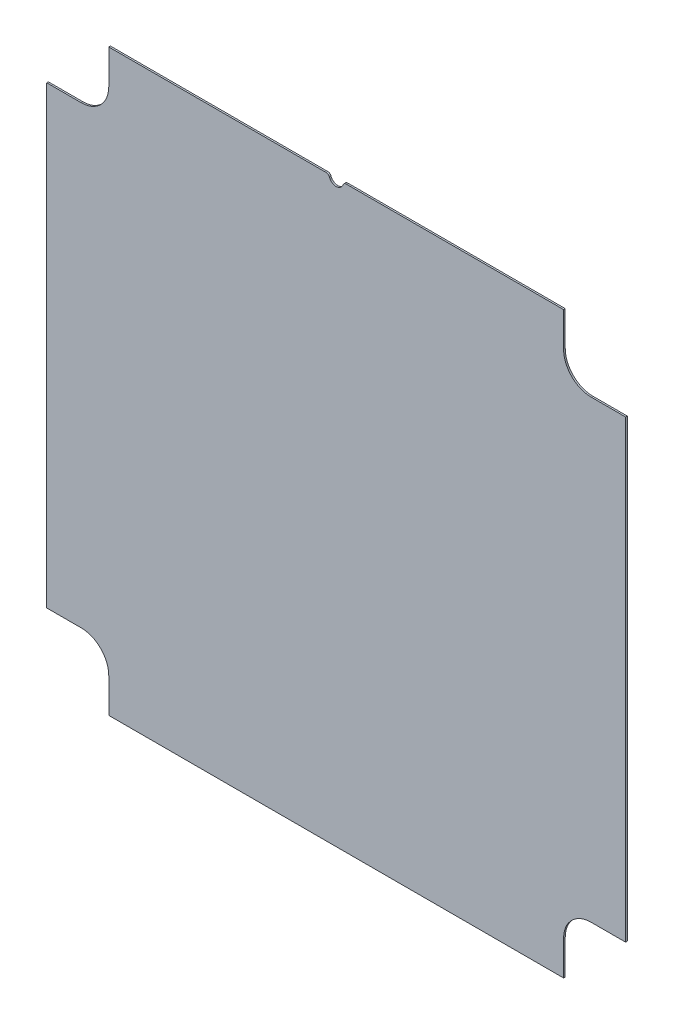
ISO-10303-21;
HEADER;
FILE_DESCRIPTION(('STEP AP214'),'2;1');
FILE_NAME('part.step','',(''),(''),'','','');
FILE_SCHEMA(('AUTOMOTIVE_DESIGN { 1 0 10303 214 1 1 1 1 }'));
ENDSEC;
DATA;
#1=APPLICATION_CONTEXT('core data for automotive mechanical design processes');
#2=APPLICATION_PROTOCOL_DEFINITION('international standard','automotive_design',2000,#1);
#3=PRODUCT_CONTEXT('',#1,'mechanical');
#4=PRODUCT('Part','Part','',(#3));
#5=PRODUCT_RELATED_PRODUCT_CATEGORY('part','',(#4));
#6=PRODUCT_DEFINITION_FORMATION('','',#4);
#7=PRODUCT_DEFINITION_CONTEXT('part definition',#1,'design');
#8=PRODUCT_DEFINITION('design','',#6,#7);
#9=PRODUCT_DEFINITION_SHAPE('','',#8);
#10=(LENGTH_UNIT() NAMED_UNIT(*) SI_UNIT(.MILLI.,.METRE.));
#11=(NAMED_UNIT(*) PLANE_ANGLE_UNIT() SI_UNIT($,.RADIAN.));
#12=(NAMED_UNIT(*) SI_UNIT($,.STERADIAN.) SOLID_ANGLE_UNIT());
#13=UNCERTAINTY_MEASURE_WITH_UNIT(LENGTH_MEASURE(1.E-05),#10,'distance_accuracy_value','');
#14=(GEOMETRIC_REPRESENTATION_CONTEXT(3) GLOBAL_UNCERTAINTY_ASSIGNED_CONTEXT((#13)) GLOBAL_UNIT_ASSIGNED_CONTEXT((#10,
#11,#12)) REPRESENTATION_CONTEXT('',''));
#15=CARTESIAN_POINT('',(0.,0.,0.));
#16=DIRECTION('',(0.,0.,1.));
#17=DIRECTION('',(1.,0.,0.));
#18=AXIS2_PLACEMENT_3D('',#15,#16,#17);
#19=CARTESIAN_POINT('',(-133.35,133.35,6.35));
#20=DIRECTION('',(0.,-1.,0.));
#21=DIRECTION('',(0.,0.,-1.));
#22=AXIS2_PLACEMENT_3D('',#19,#20,#21);
#23=PLANE('',#22);
#24=DIRECTION('',(-1.,0.,0.));
#25=VECTOR('',#24,1.);
#26=CARTESIAN_POINT('',(-133.35,133.35,6.35));
#27=LINE('',#26,#25);
#28=CARTESIAN_POINT('',(104.775,133.35,6.35));
#29=VERTEX_POINT('',#28);
#30=CARTESIAN_POINT('',(4.6246139298324,133.35,6.35));
#31=VERTEX_POINT('',#30);
#32=EDGE_CURVE('E226',#29,#31,#27,.T.);
#33=ORIENTED_EDGE('',*,*,#32,.F.);
#34=DIRECTION('',(0.,0.,1.));
#35=VECTOR('',#34,1.);
#36=CARTESIAN_POINT('',(104.775,133.35,5.58799999999997));
#37=LINE('',#36,#35);
#38=CARTESIAN_POINT('',(104.775,133.35,5.58799999999997));
#39=VERTEX_POINT('',#38);
#40=EDGE_CURVE('E270',#39,#29,#37,.T.);
#41=ORIENTED_EDGE('',*,*,#40,.F.);
#42=DIRECTION('',(1.,0.,0.));
#43=VECTOR('',#42,1.);
#44=CARTESIAN_POINT('',(-133.35,133.35,5.588));
#45=LINE('',#44,#43);
#46=CARTESIAN_POINT('',(4.6246139298324,133.35,5.588));
#47=VERTEX_POINT('',#46);
#48=EDGE_CURVE('E210',#47,#39,#45,.T.);
#49=ORIENTED_EDGE('',*,*,#48,.F.);
#50=DIRECTION('',(0.,0.,1.));
#51=VECTOR('',#50,1.);
#52=CARTESIAN_POINT('',(4.6246139298324,133.35,6.35));
#53=LINE('',#52,#51);
#54=EDGE_CURVE('E232',#47,#31,#53,.T.);
#55=ORIENTED_EDGE('',*,*,#54,.T.);
#56=EDGE_LOOP('',(#33,#41,#49,#55));
#57=FACE_BOUND('',#56,.T.);
#58=ADVANCED_FACE('F43',(#57),#23,.F.);
#59=CARTESIAN_POINT('',(0.,0.,6.35));
#60=DIRECTION('',(0.,0.,-1.));
#61=DIRECTION('',(-1.,0.,0.));
#62=AXIS2_PLACEMENT_3D('',#59,#60,#61);
#63=PLANE('',#62);
#64=DIRECTION('',(0.,1.,0.));
#65=VECTOR('',#64,1.);
#66=CARTESIAN_POINT('',(133.35,-133.35,6.35));
#67=LINE('',#66,#65);
#68=CARTESIAN_POINT('',(133.35,-104.775,6.35));
#69=VERTEX_POINT('',#68);
#70=CARTESIAN_POINT('',(133.35,104.775,6.35));
#71=VERTEX_POINT('',#70);
#72=EDGE_CURVE('E222',#69,#71,#67,.T.);
#73=ORIENTED_EDGE('',*,*,#72,.T.);
#74=DIRECTION('',(1.,0.,0.));
#75=VECTOR('',#74,1.);
#76=CARTESIAN_POINT('',(133.35,104.775,6.35));
#77=LINE('',#76,#75);
#78=CARTESIAN_POINT('',(117.475,104.775,6.35));
#79=VERTEX_POINT('',#78);
#80=EDGE_CURVE('E339',#79,#71,#77,.T.);
#81=ORIENTED_EDGE('',*,*,#80,.F.);
#82=CARTESIAN_POINT('',(117.475,117.475,6.35));
#83=DIRECTION('',(0.,0.,1.));
#84=DIRECTION('',(-1.,0.,0.));
#85=AXIS2_PLACEMENT_3D('',#82,#83,#84);
#86=CIRCLE('',#85,12.7);
#87=CARTESIAN_POINT('',(104.775,117.475,6.35));
#88=VERTEX_POINT('',#87);
#89=EDGE_CURVE('E343',#88,#79,#86,.T.);
#90=ORIENTED_EDGE('',*,*,#89,.F.);
#91=DIRECTION('',(0.,-1.,0.));
#92=VECTOR('',#91,1.);
#93=CARTESIAN_POINT('',(104.775,117.475,6.35));
#94=LINE('',#93,#92);
#95=EDGE_CURVE('E341',#29,#88,#94,.T.);
#96=ORIENTED_EDGE('',*,*,#95,.F.);
#97=ORIENTED_EDGE('',*,*,#32,.T.);
#98=CARTESIAN_POINT('',(4.62461392983241,131.7625,6.35));
#99=DIRECTION('',(0.,0.,-1.));
#100=DIRECTION('',(-1.,0.,0.));
#101=AXIS2_PLACEMENT_3D('',#98,#99,#100);
#102=CIRCLE('',#101,1.5875);
#103=CARTESIAN_POINT('',(3.12311590066604,132.277922077922,6.35));
#104=VERTEX_POINT('',#103);
#105=EDGE_CURVE('E237',#31,#104,#102,.F.);
#106=ORIENTED_EDGE('',*,*,#105,.T.);
#107=CARTESIAN_POINT('',(0.,133.35,6.35));
#108=DIRECTION('',(0.,0.,1.));
#109=DIRECTION('',(1.,0.,0.));
#110=AXIS2_PLACEMENT_3D('',#107,#108,#109);
#111=CIRCLE('',#110,3.302);
#112=CARTESIAN_POINT('',(-3.12311590066604,132.277922077922,6.35));
#113=VERTEX_POINT('',#112);
#114=EDGE_CURVE('E219',#113,#104,#111,.T.);
#115=ORIENTED_EDGE('',*,*,#114,.F.);
#116=CARTESIAN_POINT('',(-4.62461392983241,131.7625,6.35));
#117=DIRECTION('',(0.,0.,-1.));
#118=DIRECTION('',(-1.,0.,0.));
#119=AXIS2_PLACEMENT_3D('',#116,#117,#118);
#120=CIRCLE('',#119,1.5875);
#121=CARTESIAN_POINT('',(-4.6246139298324,133.35,6.35));
#122=VERTEX_POINT('',#121);
#123=EDGE_CURVE('E235',#113,#122,#120,.F.);
#124=ORIENTED_EDGE('',*,*,#123,.T.);
#125=CARTESIAN_POINT('',(-104.775,133.35,6.35));
#126=VERTEX_POINT('',#125);
#127=EDGE_CURVE('E225',#122,#126,#27,.T.);
#128=ORIENTED_EDGE('',*,*,#127,.T.);
#129=DIRECTION('',(0.,1.,0.));
#130=VECTOR('',#129,1.);
#131=CARTESIAN_POINT('',(-104.775,117.475,6.35));
#132=LINE('',#131,#130);
#133=CARTESIAN_POINT('',(-104.775,117.475,6.35));
#134=VERTEX_POINT('',#133);
#135=EDGE_CURVE('E287',#134,#126,#132,.T.);
#136=ORIENTED_EDGE('',*,*,#135,.F.);
#137=CARTESIAN_POINT('',(-117.475,117.475,6.35));
#138=DIRECTION('',(0.,0.,1.));
#139=DIRECTION('',(1.,0.,0.));
#140=AXIS2_PLACEMENT_3D('',#137,#138,#139);
#141=CIRCLE('',#140,12.7);
#142=CARTESIAN_POINT('',(-117.475,104.775,6.35));
#143=VERTEX_POINT('',#142);
#144=EDGE_CURVE('E296',#143,#134,#141,.T.);
#145=ORIENTED_EDGE('',*,*,#144,.F.);
#146=DIRECTION('',(1.,0.,0.));
#147=VECTOR('',#146,1.);
#148=CARTESIAN_POINT('',(-133.35,104.775,6.35));
#149=LINE('',#148,#147);
#150=CARTESIAN_POINT('',(-133.35,104.775,6.35));
#151=VERTEX_POINT('',#150);
#152=EDGE_CURVE('E293',#151,#143,#149,.T.);
#153=ORIENTED_EDGE('',*,*,#152,.F.);
#154=DIRECTION('',(0.,-1.,0.));
#155=VECTOR('',#154,1.);
#156=CARTESIAN_POINT('',(-133.35,-133.35,6.35));
#157=LINE('',#156,#155);
#158=CARTESIAN_POINT('',(-133.35,-104.775,6.35));
#159=VERTEX_POINT('',#158);
#160=EDGE_CURVE('E228',#151,#159,#157,.T.);
#161=ORIENTED_EDGE('',*,*,#160,.T.);
#162=DIRECTION('',(-1.,0.,0.));
#163=VECTOR('',#162,1.);
#164=CARTESIAN_POINT('',(-133.35,-104.775,6.35));
#165=LINE('',#164,#163);
#166=CARTESIAN_POINT('',(-117.475,-104.775,6.35));
#167=VERTEX_POINT('',#166);
#168=EDGE_CURVE('E187',#167,#159,#165,.T.);
#169=ORIENTED_EDGE('',*,*,#168,.F.);
#170=CARTESIAN_POINT('',(-117.475,-117.475,6.35));
#171=DIRECTION('',(0.,0.,1.));
#172=DIRECTION('',(-1.,0.,0.));
#173=AXIS2_PLACEMENT_3D('',#170,#171,#172);
#174=CIRCLE('',#173,12.7);
#175=CARTESIAN_POINT('',(-104.775,-117.475,6.35));
#176=VERTEX_POINT('',#175);
#177=EDGE_CURVE('E372',#176,#167,#174,.T.);
#178=ORIENTED_EDGE('',*,*,#177,.F.);
#179=DIRECTION('',(0.,1.,0.));
#180=VECTOR('',#179,1.);
#181=CARTESIAN_POINT('',(-104.775,-117.475,6.35));
#182=LINE('',#181,#180);
#183=CARTESIAN_POINT('',(-104.775,-133.35,6.35));
#184=VERTEX_POINT('',#183);
#185=EDGE_CURVE('E330',#184,#176,#182,.T.);
#186=ORIENTED_EDGE('',*,*,#185,.F.);
#187=DIRECTION('',(1.,0.,0.));
#188=VECTOR('',#187,1.);
#189=CARTESIAN_POINT('',(-133.35,-133.35,6.35));
#190=LINE('',#189,#188);
#191=CARTESIAN_POINT('',(104.775,-133.35,6.35));
#192=VERTEX_POINT('',#191);
#193=EDGE_CURVE('E196',#184,#192,#190,.T.);
#194=ORIENTED_EDGE('',*,*,#193,.T.);
#195=DIRECTION('',(0.,-1.,0.));
#196=VECTOR('',#195,1.);
#197=CARTESIAN_POINT('',(104.775,-117.475,6.35));
#198=LINE('',#197,#196);
#199=CARTESIAN_POINT('',(104.775,-117.475,6.35));
#200=VERTEX_POINT('',#199);
#201=EDGE_CURVE('E360',#200,#192,#198,.T.);
#202=ORIENTED_EDGE('',*,*,#201,.F.);
#203=CARTESIAN_POINT('',(117.475,-117.475,6.35));
#204=DIRECTION('',(0.,0.,1.));
#205=DIRECTION('',(1.,0.,0.));
#206=AXIS2_PLACEMENT_3D('',#203,#204,#205);
#207=CIRCLE('',#206,12.7);
#208=CARTESIAN_POINT('',(117.475,-104.775,6.35));
#209=VERTEX_POINT('',#208);
#210=EDGE_CURVE('E347',#209,#200,#207,.T.);
#211=ORIENTED_EDGE('',*,*,#210,.F.);
#212=DIRECTION('',(-1.,0.,0.));
#213=VECTOR('',#212,1.);
#214=CARTESIAN_POINT('',(133.35,-104.775,6.35));
#215=LINE('',#214,#213);
#216=EDGE_CURVE('E356',#69,#209,#215,.T.);
#217=ORIENTED_EDGE('',*,*,#216,.F.);
#218=EDGE_LOOP('',(#73,#81,#90,#96,#97,#106,#115,#124,#128,#136,#145,#153,#161,#169,#178,#186,
#194,#202,#211,#217));
#219=FACE_BOUND('',#218,.T.);
#220=ADVANCED_FACE('F354',(#219),#63,.F.);
#221=CARTESIAN_POINT('',(133.35,-133.35,6.35));
#222=DIRECTION('',(-1.,0.,0.));
#223=DIRECTION('',(0.,0.,1.));
#224=AXIS2_PLACEMENT_3D('',#221,#222,#223);
#225=PLANE('',#224);
#226=DIRECTION('',(0.,-1.,0.));
#227=VECTOR('',#226,1.);
#228=CARTESIAN_POINT('',(133.35,133.35,5.588));
#229=LINE('',#228,#227);
#230=CARTESIAN_POINT('',(133.35,104.775,5.58799999999997));
#231=VERTEX_POINT('',#230);
#232=CARTESIAN_POINT('',(133.35,-104.775,5.58799999999997));
#233=VERTEX_POINT('',#232);
#234=EDGE_CURVE('E213',#231,#233,#229,.T.);
#235=ORIENTED_EDGE('',*,*,#234,.F.);
#236=DIRECTION('',(0.,0.,1.));
#237=VECTOR('',#236,1.);
#238=CARTESIAN_POINT('',(133.35,104.775,5.58799999999997));
#239=LINE('',#238,#237);
#240=EDGE_CURVE('E322',#231,#71,#239,.T.);
#241=ORIENTED_EDGE('',*,*,#240,.T.);
#242=ORIENTED_EDGE('',*,*,#72,.F.);
#243=DIRECTION('',(0.,0.,1.));
#244=VECTOR('',#243,1.);
#245=CARTESIAN_POINT('',(133.35,-104.775,5.58799999999997));
#246=LINE('',#245,#244);
#247=EDGE_CURVE('E323',#233,#69,#246,.T.);
#248=ORIENTED_EDGE('',*,*,#247,.F.);
#249=EDGE_LOOP('',(#235,#241,#242,#248));
#250=FACE_BOUND('',#249,.T.);
#251=ADVANCED_FACE('F320',(#250),#225,.F.);
#252=CARTESIAN_POINT('',(-104.775,133.35,5.58799999999997));
#253=VERTEX_POINT('',#252);
#254=CARTESIAN_POINT('',(-4.6246139298324,133.35,5.588));
#255=VERTEX_POINT('',#254);
#256=EDGE_CURVE('E205',#253,#255,#45,.T.);
#257=ORIENTED_EDGE('',*,*,#256,.F.);
#258=DIRECTION('',(0.,0.,1.));
#259=VECTOR('',#258,1.);
#260=CARTESIAN_POINT('',(-104.775,133.35,5.58799999999997));
#261=LINE('',#260,#259);
#262=EDGE_CURVE('E301',#253,#126,#261,.T.);
#263=ORIENTED_EDGE('',*,*,#262,.T.);
#264=ORIENTED_EDGE('',*,*,#127,.F.);
#265=DIRECTION('',(0.,0.,1.));
#266=VECTOR('',#265,1.);
#267=CARTESIAN_POINT('',(-4.6246139298324,133.35,6.35));
#268=LINE('',#267,#266);
#269=EDGE_CURVE('E51',#122,#255,#268,.F.);
#270=ORIENTED_EDGE('',*,*,#269,.T.);
#271=EDGE_LOOP('',(#257,#263,#264,#270));
#272=FACE_BOUND('',#271,.T.);
#273=ADVANCED_FACE('F248',(#272),#23,.F.);
#274=CARTESIAN_POINT('',(-133.35,-133.35,6.35));
#275=DIRECTION('',(1.,0.,0.));
#276=DIRECTION('',(0.,0.,-1.));
#277=AXIS2_PLACEMENT_3D('',#274,#275,#276);
#278=PLANE('',#277);
#279=DIRECTION('',(0.,-1.,0.));
#280=VECTOR('',#279,1.);
#281=CARTESIAN_POINT('',(-133.35,133.35,5.588));
#282=LINE('',#281,#280);
#283=CARTESIAN_POINT('',(-133.35,104.775,5.58799999999997));
#284=VERTEX_POINT('',#283);
#285=CARTESIAN_POINT('',(-133.35,-104.775,5.58799999999997));
#286=VERTEX_POINT('',#285);
#287=EDGE_CURVE('E216',#284,#286,#282,.T.);
#288=ORIENTED_EDGE('',*,*,#287,.T.);
#289=DIRECTION('',(0.,0.,1.));
#290=VECTOR('',#289,1.);
#291=CARTESIAN_POINT('',(-133.35,-104.775,5.58799999999997));
#292=LINE('',#291,#290);
#293=EDGE_CURVE('E297',#286,#159,#292,.T.);
#294=ORIENTED_EDGE('',*,*,#293,.T.);
#295=ORIENTED_EDGE('',*,*,#160,.F.);
#296=DIRECTION('',(0.,0.,1.));
#297=VECTOR('',#296,1.);
#298=CARTESIAN_POINT('',(-133.35,104.775,5.58799999999997));
#299=LINE('',#298,#297);
#300=EDGE_CURVE('E292',#284,#151,#299,.T.);
#301=ORIENTED_EDGE('',*,*,#300,.F.);
#302=EDGE_LOOP('',(#288,#294,#295,#301));
#303=FACE_BOUND('',#302,.T.);
#304=ADVANCED_FACE('F383',(#303),#278,.F.);
#305=CARTESIAN_POINT('',(-133.35,-133.35,6.35));
#306=DIRECTION('',(0.,1.,0.));
#307=DIRECTION('',(0.,0.,1.));
#308=AXIS2_PLACEMENT_3D('',#305,#306,#307);
#309=PLANE('',#308);
#310=DIRECTION('',(1.,0.,0.));
#311=VECTOR('',#310,1.);
#312=CARTESIAN_POINT('',(-133.35,-133.35,5.58799999999997));
#313=LINE('',#312,#311);
#314=CARTESIAN_POINT('',(-104.775,-133.35,5.58799999999997));
#315=VERTEX_POINT('',#314);
#316=CARTESIAN_POINT('',(104.775,-133.35,5.58799999999997));
#317=VERTEX_POINT('',#316);
#318=EDGE_CURVE('E194',#315,#317,#313,.T.);
#319=ORIENTED_EDGE('',*,*,#318,.T.);
#320=DIRECTION('',(0.,0.,1.));
#321=VECTOR('',#320,1.);
#322=CARTESIAN_POINT('',(104.775,-133.35,5.58799999999997));
#323=LINE('',#322,#321);
#324=EDGE_CURVE('E328',#317,#192,#323,.T.);
#325=ORIENTED_EDGE('',*,*,#324,.T.);
#326=ORIENTED_EDGE('',*,*,#193,.F.);
#327=DIRECTION('',(0.,0.,1.));
#328=VECTOR('',#327,1.);
#329=CARTESIAN_POINT('',(-104.775,-133.35,5.58799999999997));
#330=LINE('',#329,#328);
#331=EDGE_CURVE('E182',#315,#184,#330,.T.);
#332=ORIENTED_EDGE('',*,*,#331,.F.);
#333=EDGE_LOOP('',(#319,#325,#326,#332));
#334=FACE_BOUND('',#333,.T.);
#335=ADVANCED_FACE('F192',(#334),#309,.F.);
#336=CARTESIAN_POINT('',(0.,133.35,0.));
#337=DIRECTION('',(0.,0.,1.));
#338=DIRECTION('',(1.,0.,0.));
#339=AXIS2_PLACEMENT_3D('',#336,#337,#338);
#340=CYLINDRICAL_SURFACE('',#339,3.302);
#341=DIRECTION('',(0.,0.,1.));
#342=VECTOR('',#341,1.);
#343=CARTESIAN_POINT('',(3.12311590066605,132.277922077922,0.));
#344=LINE('',#343,#342);
#345=CARTESIAN_POINT('',(3.12311590066605,132.277922077922,5.588));
#346=VERTEX_POINT('',#345);
#347=EDGE_CURVE('E241',#104,#346,#344,.F.);
#348=ORIENTED_EDGE('',*,*,#347,.T.);
#349=CARTESIAN_POINT('',(0.,133.35,5.588));
#350=DIRECTION('',(0.,0.,1.));
#351=DIRECTION('',(0.,-1.,0.));
#352=AXIS2_PLACEMENT_3D('',#349,#350,#351);
#353=CIRCLE('',#352,3.302);
#354=CARTESIAN_POINT('',(-3.12311590066604,132.277922077922,5.588));
#355=VERTEX_POINT('',#354);
#356=EDGE_CURVE('E204',#346,#355,#353,.F.);
#357=ORIENTED_EDGE('',*,*,#356,.T.);
#358=DIRECTION('',(0.,0.,1.));
#359=VECTOR('',#358,1.);
#360=CARTESIAN_POINT('',(-3.12311590066605,132.277922077922,0.));
#361=LINE('',#360,#359);
#362=EDGE_CURVE('E239',#355,#113,#361,.T.);
#363=ORIENTED_EDGE('',*,*,#362,.T.);
#364=ORIENTED_EDGE('',*,*,#114,.T.);
#365=EDGE_LOOP('',(#348,#357,#363,#364));
#366=FACE_BOUND('',#365,.T.);
#367=ADVANCED_FACE('F258',(#366),#340,.F.);
#368=CARTESIAN_POINT('',(4.62461392983241,131.7625,0.));
#369=DIRECTION('',(0.,0.,1.));
#370=DIRECTION('',(1.,0.,0.));
#371=AXIS2_PLACEMENT_3D('',#368,#369,#370);
#372=CYLINDRICAL_SURFACE('',#371,1.5875);
#373=CARTESIAN_POINT('',(4.62461392983241,131.7625,5.588));
#374=DIRECTION('',(0.,0.,1.));
#375=DIRECTION('',(0.,-1.,0.));
#376=AXIS2_PLACEMENT_3D('',#373,#374,#375);
#377=CIRCLE('',#376,1.5875);
#378=EDGE_CURVE('E208',#346,#47,#377,.F.);
#379=ORIENTED_EDGE('',*,*,#378,.F.);
#380=ORIENTED_EDGE('',*,*,#347,.F.);
#381=ORIENTED_EDGE('',*,*,#105,.F.);
#382=ORIENTED_EDGE('',*,*,#54,.F.);
#383=EDGE_LOOP('',(#379,#380,#381,#382));
#384=FACE_BOUND('',#383,.T.);
#385=ADVANCED_FACE('F263',(#384),#372,.T.);
#386=CARTESIAN_POINT('',(-4.62461392983241,131.7625,0.));
#387=DIRECTION('',(0.,0.,1.));
#388=DIRECTION('',(1.,0.,0.));
#389=AXIS2_PLACEMENT_3D('',#386,#387,#388);
#390=CYLINDRICAL_SURFACE('',#389,1.5875);
#391=CARTESIAN_POINT('',(-4.62461392983241,131.7625,5.588));
#392=DIRECTION('',(0.,0.,1.));
#393=DIRECTION('',(0.,-1.,0.));
#394=AXIS2_PLACEMENT_3D('',#391,#392,#393);
#395=CIRCLE('',#394,1.5875);
#396=EDGE_CURVE('E11',#255,#355,#395,.F.);
#397=ORIENTED_EDGE('',*,*,#396,.F.);
#398=ORIENTED_EDGE('',*,*,#269,.F.);
#399=ORIENTED_EDGE('',*,*,#123,.F.);
#400=ORIENTED_EDGE('',*,*,#362,.F.);
#401=EDGE_LOOP('',(#397,#398,#399,#400));
#402=FACE_BOUND('',#401,.T.);
#403=ADVANCED_FACE('F45',(#402),#390,.T.);
#404=CARTESIAN_POINT('',(-133.35,133.35,5.588));
#405=DIRECTION('',(0.,0.,1.));
#406=DIRECTION('',(0.,-1.,0.));
#407=AXIS2_PLACEMENT_3D('',#404,#405,#406);
#408=PLANE('',#407);
#409=CARTESIAN_POINT('',(117.475,117.475,5.58799999999997));
#410=DIRECTION('',(0.,0.,1.));
#411=DIRECTION('',(-1.,0.,0.));
#412=AXIS2_PLACEMENT_3D('',#409,#410,#411);
#413=CIRCLE('',#412,12.7);
#414=CARTESIAN_POINT('',(104.775,117.475,5.588));
#415=VERTEX_POINT('',#414);
#416=CARTESIAN_POINT('',(117.475,104.775,5.58799999999997));
#417=VERTEX_POINT('',#416);
#418=EDGE_CURVE('E58',#415,#417,#413,.T.);
#419=ORIENTED_EDGE('',*,*,#418,.T.);
#420=DIRECTION('',(1.,0.,0.));
#421=VECTOR('',#420,1.);
#422=CARTESIAN_POINT('',(133.35,104.775,5.58799999999997));
#423=LINE('',#422,#421);
#424=EDGE_CURVE('E275',#417,#231,#423,.T.);
#425=ORIENTED_EDGE('',*,*,#424,.T.);
#426=ORIENTED_EDGE('',*,*,#234,.T.);
#427=DIRECTION('',(-1.,0.,0.));
#428=VECTOR('',#427,1.);
#429=CARTESIAN_POINT('',(133.35,-104.775,5.58799999999997));
#430=LINE('',#429,#428);
#431=CARTESIAN_POINT('',(117.475,-104.775,5.58799999999997));
#432=VERTEX_POINT('',#431);
#433=EDGE_CURVE('E315',#233,#432,#430,.T.);
#434=ORIENTED_EDGE('',*,*,#433,.T.);
#435=CARTESIAN_POINT('',(117.475,-117.475,5.58799999999997));
#436=DIRECTION('',(0.,0.,1.));
#437=DIRECTION('',(1.,0.,0.));
#438=AXIS2_PLACEMENT_3D('',#435,#436,#437);
#439=CIRCLE('',#438,12.7);
#440=CARTESIAN_POINT('',(104.775,-117.475,5.58799999999997));
#441=VERTEX_POINT('',#440);
#442=EDGE_CURVE('E359',#432,#441,#439,.T.);
#443=ORIENTED_EDGE('',*,*,#442,.T.);
#444=DIRECTION('',(0.,-1.,0.));
#445=VECTOR('',#444,1.);
#446=CARTESIAN_POINT('',(104.775,-117.475,5.58799999999997));
#447=LINE('',#446,#445);
#448=EDGE_CURVE('E203',#441,#317,#447,.T.);
#449=ORIENTED_EDGE('',*,*,#448,.T.);
#450=ORIENTED_EDGE('',*,*,#318,.F.);
#451=DIRECTION('',(0.,1.,0.));
#452=VECTOR('',#451,1.);
#453=CARTESIAN_POINT('',(-104.775,-117.475,5.58799999999997));
#454=LINE('',#453,#452);
#455=CARTESIAN_POINT('',(-104.775,-117.475,5.58799999999997));
#456=VERTEX_POINT('',#455);
#457=EDGE_CURVE('E178',#315,#456,#454,.T.);
#458=ORIENTED_EDGE('',*,*,#457,.T.);
#459=CARTESIAN_POINT('',(-117.475,-117.475,5.58799999999997));
#460=DIRECTION('',(0.,0.,1.));
#461=DIRECTION('',(-1.,0.,0.));
#462=AXIS2_PLACEMENT_3D('',#459,#460,#461);
#463=CIRCLE('',#462,12.7);
#464=CARTESIAN_POINT('',(-117.475,-104.775,5.58799999999997));
#465=VERTEX_POINT('',#464);
#466=EDGE_CURVE('E66',#456,#465,#463,.T.);
#467=ORIENTED_EDGE('',*,*,#466,.T.);
#468=DIRECTION('',(-1.,0.,0.));
#469=VECTOR('',#468,1.);
#470=CARTESIAN_POINT('',(-133.35,-104.775,5.58799999999997));
#471=LINE('',#470,#469);
#472=EDGE_CURVE('E197',#465,#286,#471,.T.);
#473=ORIENTED_EDGE('',*,*,#472,.T.);
#474=ORIENTED_EDGE('',*,*,#287,.F.);
#475=DIRECTION('',(1.,0.,0.));
#476=VECTOR('',#475,1.);
#477=CARTESIAN_POINT('',(-133.35,104.775,5.58799999999997));
#478=LINE('',#477,#476);
#479=CARTESIAN_POINT('',(-117.475,104.775,5.588));
#480=VERTEX_POINT('',#479);
#481=EDGE_CURVE('E283',#284,#480,#478,.T.);
#482=ORIENTED_EDGE('',*,*,#481,.T.);
#483=CARTESIAN_POINT('',(-117.475,117.475,5.58799999999997));
#484=DIRECTION('',(0.,0.,1.));
#485=DIRECTION('',(1.,0.,0.));
#486=AXIS2_PLACEMENT_3D('',#483,#484,#485);
#487=CIRCLE('',#486,12.7);
#488=CARTESIAN_POINT('',(-104.775,117.475,5.58799999999997));
#489=VERTEX_POINT('',#488);
#490=EDGE_CURVE('E286',#480,#489,#487,.T.);
#491=ORIENTED_EDGE('',*,*,#490,.T.);
#492=DIRECTION('',(0.,1.,0.));
#493=VECTOR('',#492,1.);
#494=CARTESIAN_POINT('',(-104.775,117.475,5.58799999999997));
#495=LINE('',#494,#493);
#496=EDGE_CURVE('E290',#489,#253,#495,.T.);
#497=ORIENTED_EDGE('',*,*,#496,.T.);
#498=ORIENTED_EDGE('',*,*,#256,.T.);
#499=ORIENTED_EDGE('',*,*,#396,.T.);
#500=ORIENTED_EDGE('',*,*,#356,.F.);
#501=ORIENTED_EDGE('',*,*,#378,.T.);
#502=ORIENTED_EDGE('',*,*,#48,.T.);
#503=DIRECTION('',(0.,-1.,0.));
#504=VECTOR('',#503,1.);
#505=CARTESIAN_POINT('',(104.775,117.475,5.58799999999997));
#506=LINE('',#505,#504);
#507=EDGE_CURVE('E337',#39,#415,#506,.T.);
#508=ORIENTED_EDGE('',*,*,#507,.T.);
#509=EDGE_LOOP('',(#419,#425,#426,#434,#443,#449,#450,#458,#467,#473,#474,#482,#491,#497,#498,
#499,#500,#501,#502,#508));
#510=FACE_BOUND('',#509,.T.);
#511=ADVANCED_FACE('F200',(#510),#408,.F.);
#512=CARTESIAN_POINT('',(-104.775,117.475,5.58799999999997));
#513=DIRECTION('',(1.,0.,0.));
#514=DIRECTION('',(0.,0.,-1.));
#515=AXIS2_PLACEMENT_3D('',#512,#513,#514);
#516=PLANE('',#515);
#517=ORIENTED_EDGE('',*,*,#135,.T.);
#518=ORIENTED_EDGE('',*,*,#262,.F.);
#519=ORIENTED_EDGE('',*,*,#496,.F.);
#520=DIRECTION('',(0.,0.,1.));
#521=VECTOR('',#520,1.);
#522=CARTESIAN_POINT('',(-104.775,117.475,5.58799999999997));
#523=LINE('',#522,#521);
#524=EDGE_CURVE('E303',#489,#134,#523,.T.);
#525=ORIENTED_EDGE('',*,*,#524,.T.);
#526=EDGE_LOOP('',(#517,#518,#519,#525));
#527=FACE_BOUND('',#526,.T.);
#528=ADVANCED_FACE('F395',(#527),#516,.F.);
#529=CARTESIAN_POINT('',(-117.475,117.475,5.58799999999997));
#530=DIRECTION('',(0.,0.,1.));
#531=DIRECTION('',(1.,0.,0.));
#532=AXIS2_PLACEMENT_3D('',#529,#530,#531);
#533=CYLINDRICAL_SURFACE('',#532,12.7);
#534=ORIENTED_EDGE('',*,*,#144,.T.);
#535=ORIENTED_EDGE('',*,*,#524,.F.);
#536=ORIENTED_EDGE('',*,*,#490,.F.);
#537=DIRECTION('',(0.,0.,1.));
#538=VECTOR('',#537,1.);
#539=CARTESIAN_POINT('',(-117.475,104.775,5.58799999999997));
#540=LINE('',#539,#538);
#541=EDGE_CURVE('E305',#480,#143,#540,.T.);
#542=ORIENTED_EDGE('',*,*,#541,.T.);
#543=EDGE_LOOP('',(#534,#535,#536,#542));
#544=FACE_BOUND('',#543,.T.);
#545=ADVANCED_FACE('F393',(#544),#533,.F.);
#546=CARTESIAN_POINT('',(-133.35,104.775,5.58799999999997));
#547=DIRECTION('',(0.,-1.,0.));
#548=DIRECTION('',(1.,0.,0.));
#549=AXIS2_PLACEMENT_3D('',#546,#547,#548);
#550=PLANE('',#549);
#551=ORIENTED_EDGE('',*,*,#152,.T.);
#552=ORIENTED_EDGE('',*,*,#541,.F.);
#553=ORIENTED_EDGE('',*,*,#481,.F.);
#554=ORIENTED_EDGE('',*,*,#300,.T.);
#555=EDGE_LOOP('',(#551,#552,#553,#554));
#556=FACE_BOUND('',#555,.T.);
#557=ADVANCED_FACE('F390',(#556),#550,.F.);
#558=CARTESIAN_POINT('',(-133.35,-104.775,5.58799999999997));
#559=DIRECTION('',(0.,1.,0.));
#560=DIRECTION('',(-1.,0.,0.));
#561=AXIS2_PLACEMENT_3D('',#558,#559,#560);
#562=PLANE('',#561);
#563=ORIENTED_EDGE('',*,*,#168,.T.);
#564=ORIENTED_EDGE('',*,*,#293,.F.);
#565=ORIENTED_EDGE('',*,*,#472,.F.);
#566=DIRECTION('',(0.,0.,1.));
#567=VECTOR('',#566,1.);
#568=CARTESIAN_POINT('',(-117.475,-104.775,5.58799999999997));
#569=LINE('',#568,#567);
#570=EDGE_CURVE('E368',#465,#167,#569,.T.);
#571=ORIENTED_EDGE('',*,*,#570,.T.);
#572=EDGE_LOOP('',(#563,#564,#565,#571));
#573=FACE_BOUND('',#572,.T.);
#574=ADVANCED_FACE('F380',(#573),#562,.F.);
#575=CARTESIAN_POINT('',(-117.475,-117.475,5.58799999999997));
#576=DIRECTION('',(0.,0.,1.));
#577=DIRECTION('',(1.,0.,0.));
#578=AXIS2_PLACEMENT_3D('',#575,#576,#577);
#579=CYLINDRICAL_SURFACE('',#578,12.7);
#580=ORIENTED_EDGE('',*,*,#177,.T.);
#581=ORIENTED_EDGE('',*,*,#570,.F.);
#582=ORIENTED_EDGE('',*,*,#466,.F.);
#583=DIRECTION('',(0.,0.,1.));
#584=VECTOR('',#583,1.);
#585=CARTESIAN_POINT('',(-104.775,-117.475,5.58799999999997));
#586=LINE('',#585,#584);
#587=EDGE_CURVE('E184',#456,#176,#586,.T.);
#588=ORIENTED_EDGE('',*,*,#587,.T.);
#589=EDGE_LOOP('',(#580,#581,#582,#588));
#590=FACE_BOUND('',#589,.T.);
#591=ADVANCED_FACE('F454',(#590),#579,.F.);
#592=CARTESIAN_POINT('',(-104.775,-117.475,5.58799999999997));
#593=DIRECTION('',(1.,0.,0.));
#594=DIRECTION('',(0.,0.,-1.));
#595=AXIS2_PLACEMENT_3D('',#592,#593,#594);
#596=PLANE('',#595);
#597=ORIENTED_EDGE('',*,*,#185,.T.);
#598=ORIENTED_EDGE('',*,*,#587,.F.);
#599=ORIENTED_EDGE('',*,*,#457,.F.);
#600=ORIENTED_EDGE('',*,*,#331,.T.);
#601=EDGE_LOOP('',(#597,#598,#599,#600));
#602=FACE_BOUND('',#601,.T.);
#603=ADVANCED_FACE('F181',(#602),#596,.F.);
#604=CARTESIAN_POINT('',(117.475,-117.475,5.58799999999997));
#605=DIRECTION('',(0.,0.,1.));
#606=DIRECTION('',(1.,0.,0.));
#607=AXIS2_PLACEMENT_3D('',#604,#605,#606);
#608=CYLINDRICAL_SURFACE('',#607,12.7);
#609=ORIENTED_EDGE('',*,*,#210,.T.);
#610=DIRECTION('',(0.,0.,1.));
#611=VECTOR('',#610,1.);
#612=CARTESIAN_POINT('',(104.775,-117.475,5.58799999999997));
#613=LINE('',#612,#611);
#614=EDGE_CURVE('E332',#441,#200,#613,.T.);
#615=ORIENTED_EDGE('',*,*,#614,.F.);
#616=ORIENTED_EDGE('',*,*,#442,.F.);
#617=DIRECTION('',(0.,0.,1.));
#618=VECTOR('',#617,1.);
#619=CARTESIAN_POINT('',(117.475,-104.775,5.58799999999997));
#620=LINE('',#619,#618);
#621=EDGE_CURVE('E327',#432,#209,#620,.T.);
#622=ORIENTED_EDGE('',*,*,#621,.T.);
#623=EDGE_LOOP('',(#609,#615,#616,#622));
#624=FACE_BOUND('',#623,.T.);
#625=ADVANCED_FACE('F467',(#624),#608,.F.);
#626=CARTESIAN_POINT('',(133.35,-104.775,5.58799999999997));
#627=DIRECTION('',(0.,1.,0.));
#628=DIRECTION('',(-1.,0.,0.));
#629=AXIS2_PLACEMENT_3D('',#626,#627,#628);
#630=PLANE('',#629);
#631=ORIENTED_EDGE('',*,*,#216,.T.);
#632=ORIENTED_EDGE('',*,*,#621,.F.);
#633=ORIENTED_EDGE('',*,*,#433,.F.);
#634=ORIENTED_EDGE('',*,*,#247,.T.);
#635=EDGE_LOOP('',(#631,#632,#633,#634));
#636=FACE_BOUND('',#635,.T.);
#637=ADVANCED_FACE('F474',(#636),#630,.F.);
#638=CARTESIAN_POINT('',(104.775,-117.475,5.58799999999997));
#639=DIRECTION('',(-1.,0.,0.));
#640=DIRECTION('',(0.,0.,1.));
#641=AXIS2_PLACEMENT_3D('',#638,#639,#640);
#642=PLANE('',#641);
#643=ORIENTED_EDGE('',*,*,#201,.T.);
#644=ORIENTED_EDGE('',*,*,#324,.F.);
#645=ORIENTED_EDGE('',*,*,#448,.F.);
#646=ORIENTED_EDGE('',*,*,#614,.T.);
#647=EDGE_LOOP('',(#643,#644,#645,#646));
#648=FACE_BOUND('',#647,.T.);
#649=ADVANCED_FACE('F482',(#648),#642,.F.);
#650=CARTESIAN_POINT('',(133.35,104.775,5.58799999999997));
#651=DIRECTION('',(0.,-1.,0.));
#652=DIRECTION('',(1.,0.,0.));
#653=AXIS2_PLACEMENT_3D('',#650,#651,#652);
#654=PLANE('',#653);
#655=ORIENTED_EDGE('',*,*,#80,.T.);
#656=ORIENTED_EDGE('',*,*,#240,.F.);
#657=ORIENTED_EDGE('',*,*,#424,.F.);
#658=DIRECTION('',(0.,0.,1.));
#659=VECTOR('',#658,1.);
#660=CARTESIAN_POINT('',(117.475,104.775,5.58799999999997));
#661=LINE('',#660,#659);
#662=EDGE_CURVE('E277',#417,#79,#661,.T.);
#663=ORIENTED_EDGE('',*,*,#662,.T.);
#664=EDGE_LOOP('',(#655,#656,#657,#663));
#665=FACE_BOUND('',#664,.T.);
#666=ADVANCED_FACE('F349',(#665),#654,.F.);
#667=CARTESIAN_POINT('',(117.475,117.475,5.58799999999997));
#668=DIRECTION('',(0.,0.,1.));
#669=DIRECTION('',(1.,0.,0.));
#670=AXIS2_PLACEMENT_3D('',#667,#668,#669);
#671=CYLINDRICAL_SURFACE('',#670,12.7);
#672=ORIENTED_EDGE('',*,*,#89,.T.);
#673=ORIENTED_EDGE('',*,*,#662,.F.);
#674=ORIENTED_EDGE('',*,*,#418,.F.);
#675=DIRECTION('',(0.,0.,1.));
#676=VECTOR('',#675,1.);
#677=CARTESIAN_POINT('',(104.775,117.475,5.58799999999997));
#678=LINE('',#677,#676);
#679=EDGE_CURVE('E274',#415,#88,#678,.T.);
#680=ORIENTED_EDGE('',*,*,#679,.T.);
#681=EDGE_LOOP('',(#672,#673,#674,#680));
#682=FACE_BOUND('',#681,.T.);
#683=ADVANCED_FACE('F352',(#682),#671,.F.);
#684=CARTESIAN_POINT('',(104.775,117.475,5.58799999999997));
#685=DIRECTION('',(-1.,0.,0.));
#686=DIRECTION('',(0.,0.,1.));
#687=AXIS2_PLACEMENT_3D('',#684,#685,#686);
#688=PLANE('',#687);
#689=ORIENTED_EDGE('',*,*,#95,.T.);
#690=ORIENTED_EDGE('',*,*,#679,.F.);
#691=ORIENTED_EDGE('',*,*,#507,.F.);
#692=ORIENTED_EDGE('',*,*,#40,.T.);
#693=EDGE_LOOP('',(#689,#690,#691,#692));
#694=FACE_BOUND('',#693,.T.);
#695=ADVANCED_FACE('F396',(#694),#688,.F.);
#696=CLOSED_SHELL('',(#58,#220,#251,#273,#304,#335,#367,#385,#403,#511,#528,#545,#557,#574,#591,
#603,#625,#637,#649,#666,#683,#695));
#697=MANIFOLD_SOLID_BREP('B2',#696);
#698=ADVANCED_BREP_SHAPE_REPRESENTATION('',(#18,#697),#14);
#699=SHAPE_DEFINITION_REPRESENTATION(#9,#698);
ENDSEC;
END-ISO-10303-21;
